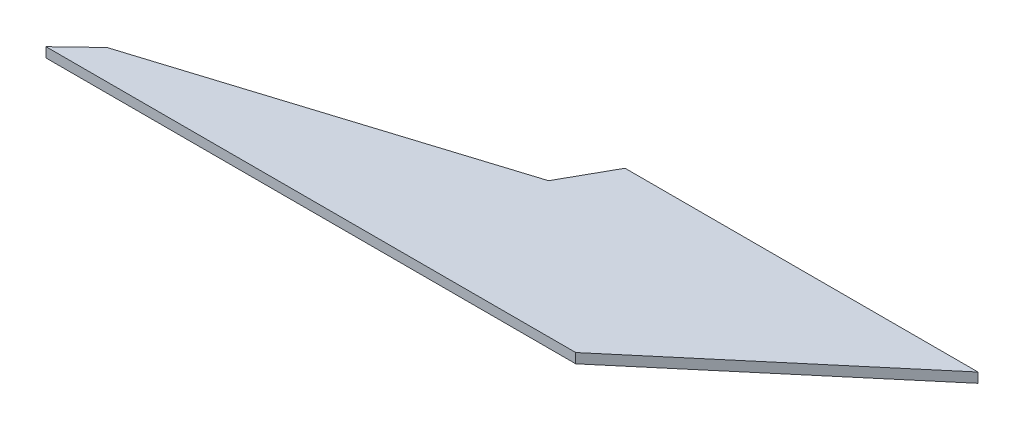
ISO-10303-21;
HEADER;
FILE_DESCRIPTION(('STEP AP214'),'2;1');
FILE_NAME('part.step','',(''),(''),'','','');
FILE_SCHEMA(('AUTOMOTIVE_DESIGN { 1 0 10303 214 1 1 1 1 }'));
ENDSEC;
DATA;
#1=APPLICATION_CONTEXT('core data for automotive mechanical design processes');
#2=APPLICATION_PROTOCOL_DEFINITION('international standard','automotive_design',2000,#1);
#3=PRODUCT_CONTEXT('',#1,'mechanical');
#4=PRODUCT('Part','Part','',(#3));
#5=PRODUCT_RELATED_PRODUCT_CATEGORY('part','',(#4));
#6=PRODUCT_DEFINITION_FORMATION('','',#4);
#7=PRODUCT_DEFINITION_CONTEXT('part definition',#1,'design');
#8=PRODUCT_DEFINITION('design','',#6,#7);
#9=PRODUCT_DEFINITION_SHAPE('','',#8);
#10=(LENGTH_UNIT() NAMED_UNIT(*) SI_UNIT(.MILLI.,.METRE.));
#11=(NAMED_UNIT(*) PLANE_ANGLE_UNIT() SI_UNIT($,.RADIAN.));
#12=(NAMED_UNIT(*) SI_UNIT($,.STERADIAN.) SOLID_ANGLE_UNIT());
#13=UNCERTAINTY_MEASURE_WITH_UNIT(LENGTH_MEASURE(1.E-05),#10,'distance_accuracy_value','');
#14=(GEOMETRIC_REPRESENTATION_CONTEXT(3) GLOBAL_UNCERTAINTY_ASSIGNED_CONTEXT((#13)) GLOBAL_UNIT_ASSIGNED_CONTEXT((#10,
#11,#12)) REPRESENTATION_CONTEXT('',''));
#15=CARTESIAN_POINT('',(0.,0.,0.));
#16=DIRECTION('',(0.,0.,1.));
#17=DIRECTION('',(1.,0.,0.));
#18=AXIS2_PLACEMENT_3D('',#15,#16,#17);
#19=CARTESIAN_POINT('',(80.5472641903663,2.,-37.5903219618737));
#20=DIRECTION('',(0.872762472166522,0.,0.488145129216487));
#21=DIRECTION('',(0.488145129216487,0.,-0.872762472166522));
#22=AXIS2_PLACEMENT_3D('',#19,#20,#21);
#23=PLANE('',#22);
#24=DIRECTION('',(-0.488145129216487,0.,0.872762472166522));
#25=VECTOR('',#24,1.);
#26=CARTESIAN_POINT('',(80.5472641903663,0.,-37.5903219618737));
#27=LINE('',#26,#25);
#28=CARTESIAN_POINT('',(80.5472641903663,0.,-37.5903219618737));
#29=VERTEX_POINT('',#28);
#30=CARTESIAN_POINT('',(74.9512614669705,0.,-27.5851393249791));
#31=VERTEX_POINT('',#30);
#32=EDGE_CURVE('E128',#29,#31,#27,.T.);
#33=ORIENTED_EDGE('',*,*,#32,.T.);
#34=DIRECTION('',(0.,-1.,0.));
#35=VECTOR('',#34,1.);
#36=CARTESIAN_POINT('',(74.9512614669705,2.,-27.5851393249791));
#37=LINE('',#36,#35);
#38=CARTESIAN_POINT('',(74.9512614669705,2.,-27.5851393249791));
#39=VERTEX_POINT('',#38);
#40=EDGE_CURVE('E11',#39,#31,#37,.T.);
#41=ORIENTED_EDGE('',*,*,#40,.F.);
#42=DIRECTION('',(-0.488145129216487,0.,0.872762472166522));
#43=VECTOR('',#42,1.);
#44=CARTESIAN_POINT('',(80.5472641903663,2.,-37.5903219618737));
#45=LINE('',#44,#43);
#46=CARTESIAN_POINT('',(80.5472641903663,2.,-37.5903219618737));
#47=VERTEX_POINT('',#46);
#48=EDGE_CURVE('E144',#47,#39,#45,.T.);
#49=ORIENTED_EDGE('',*,*,#48,.F.);
#50=DIRECTION('',(0.,-1.,0.));
#51=VECTOR('',#50,1.);
#52=CARTESIAN_POINT('',(80.5472641903663,2.,-37.5903219618737));
#53=LINE('',#52,#51);
#54=EDGE_CURVE('E124',#47,#29,#53,.T.);
#55=ORIENTED_EDGE('',*,*,#54,.T.);
#56=EDGE_LOOP('',(#33,#41,#49,#55));
#57=FACE_BOUND('',#56,.T.);
#58=ADVANCED_FACE('F39',(#57),#23,.F.);
#59=CARTESIAN_POINT('',(74.9512614669705,2.,-27.5851393249791));
#60=DIRECTION('',(0.299252637327374,0.,0.954173914468747));
#61=DIRECTION('',(0.954173914468747,0.,-0.299252637327374));
#62=AXIS2_PLACEMENT_3D('',#59,#60,#61);
#63=PLANE('',#62);
#64=DIRECTION('',(-0.954173914468747,0.,0.299252637327374));
#65=VECTOR('',#64,1.);
#66=CARTESIAN_POINT('',(74.9512614669705,0.,-27.5851393249791));
#67=LINE('',#66,#65);
#68=CARTESIAN_POINT('',(6.36680299605791,0.,-6.07534979303881));
#69=VERTEX_POINT('',#68);
#70=EDGE_CURVE('E132',#31,#69,#67,.T.);
#71=ORIENTED_EDGE('',*,*,#70,.T.);
#72=DIRECTION('',(0.,-1.,0.));
#73=VECTOR('',#72,1.);
#74=CARTESIAN_POINT('',(6.36680299605791,2.,-6.07534979303881));
#75=LINE('',#74,#73);
#76=CARTESIAN_POINT('',(6.36680299605791,2.,-6.07534979303881));
#77=VERTEX_POINT('',#76);
#78=EDGE_CURVE('E48',#77,#69,#75,.T.);
#79=ORIENTED_EDGE('',*,*,#78,.F.);
#80=DIRECTION('',(-0.954173914468747,0.,0.299252637327374));
#81=VECTOR('',#80,1.);
#82=CARTESIAN_POINT('',(74.9512614669705,2.,-27.5851393249791));
#83=LINE('',#82,#81);
#84=EDGE_CURVE('E93',#39,#77,#83,.T.);
#85=ORIENTED_EDGE('',*,*,#84,.F.);
#86=ORIENTED_EDGE('',*,*,#40,.T.);
#87=EDGE_LOOP('',(#71,#79,#85,#86));
#88=FACE_BOUND('',#87,.T.);
#89=ADVANCED_FACE('F172',(#88),#63,.F.);
#90=CARTESIAN_POINT('',(6.36680299605791,2.,-6.07534979303881));
#91=DIRECTION('',(0.69035366737915,0.,0.723472054702984));
#92=DIRECTION('',(0.723472054702984,0.,-0.69035366737915));
#93=AXIS2_PLACEMENT_3D('',#90,#91,#92);
#94=PLANE('',#93);
#95=DIRECTION('',(-0.723472054702984,0.,0.69035366737915));
#96=VECTOR('',#95,1.);
#97=CARTESIAN_POINT('',(6.36680299605791,0.,-6.07534979303881));
#98=LINE('',#97,#96);
#99=CARTESIAN_POINT('',(0.,0.,0.));
#100=VERTEX_POINT('',#99);
#101=EDGE_CURVE('E135',#69,#100,#98,.T.);
#102=ORIENTED_EDGE('',*,*,#101,.T.);
#103=DIRECTION('',(0.,-1.,0.));
#104=VECTOR('',#103,1.);
#105=CARTESIAN_POINT('',(0.,2.,0.));
#106=LINE('',#105,#104);
#107=CARTESIAN_POINT('',(0.,2.,0.));
#108=VERTEX_POINT('',#107);
#109=EDGE_CURVE('E117',#108,#100,#106,.T.);
#110=ORIENTED_EDGE('',*,*,#109,.F.);
#111=DIRECTION('',(-0.723472054702984,0.,0.69035366737915));
#112=VECTOR('',#111,1.);
#113=CARTESIAN_POINT('',(6.36680299605791,2.,-6.07534979303881));
#114=LINE('',#113,#112);
#115=EDGE_CURVE('E106',#77,#108,#114,.T.);
#116=ORIENTED_EDGE('',*,*,#115,.F.);
#117=ORIENTED_EDGE('',*,*,#78,.T.);
#118=EDGE_LOOP('',(#102,#110,#116,#117));
#119=FACE_BOUND('',#118,.T.);
#120=ADVANCED_FACE('F154',(#119),#94,.F.);
#121=CARTESIAN_POINT('',(0.,2.,0.));
#122=DIRECTION('',(0.,0.,-1.));
#123=DIRECTION('',(-1.,0.,0.));
#124=AXIS2_PLACEMENT_3D('',#121,#122,#123);
#125=PLANE('',#124);
#126=DIRECTION('',(1.,0.,0.));
#127=VECTOR('',#126,1.);
#128=CARTESIAN_POINT('',(0.,0.,0.));
#129=LINE('',#128,#127);
#130=CARTESIAN_POINT('',(108.078397399704,0.,0.));
#131=VERTEX_POINT('',#130);
#132=EDGE_CURVE('E115',#100,#131,#129,.T.);
#133=ORIENTED_EDGE('',*,*,#132,.T.);
#134=DIRECTION('',(0.,-1.,0.));
#135=VECTOR('',#134,1.);
#136=CARTESIAN_POINT('',(108.078397399704,2.,0.));
#137=LINE('',#136,#135);
#138=CARTESIAN_POINT('',(108.078397399704,2.,0.));
#139=VERTEX_POINT('',#138);
#140=EDGE_CURVE('E112',#139,#131,#137,.T.);
#141=ORIENTED_EDGE('',*,*,#140,.F.);
#142=DIRECTION('',(1.,0.,0.));
#143=VECTOR('',#142,1.);
#144=CARTESIAN_POINT('',(0.,2.,0.));
#145=LINE('',#144,#143);
#146=EDGE_CURVE('E100',#108,#139,#145,.T.);
#147=ORIENTED_EDGE('',*,*,#146,.F.);
#148=ORIENTED_EDGE('',*,*,#109,.T.);
#149=EDGE_LOOP('',(#133,#141,#147,#148));
#150=FACE_BOUND('',#149,.T.);
#151=ADVANCED_FACE('F113',(#150),#125,.F.);
#152=CARTESIAN_POINT('',(108.078397399704,2.,0.));
#153=DIRECTION('',(-0.645466040393807,0.,-0.763788970003063));
#154=DIRECTION('',(-0.763788970003063,0.,0.645466040393807));
#155=AXIS2_PLACEMENT_3D('',#152,#153,#154);
#156=PLANE('',#155);
#157=DIRECTION('',(0.763788970003063,0.,-0.645466040393807));
#158=VECTOR('',#157,1.);
#159=CARTESIAN_POINT('',(108.078397399704,0.,0.));
#160=LINE('',#159,#158);
#161=CARTESIAN_POINT('',(152.559549771138,0.,-37.5903219618736));
#162=VERTEX_POINT('',#161);
#163=EDGE_CURVE('E79',#131,#162,#160,.T.);
#164=ORIENTED_EDGE('',*,*,#163,.T.);
#165=DIRECTION('',(0.,-1.,0.));
#166=VECTOR('',#165,1.);
#167=CARTESIAN_POINT('',(152.559549771138,2.,-37.5903219618736));
#168=LINE('',#167,#166);
#169=CARTESIAN_POINT('',(152.559549771138,2.,-37.5903219618736));
#170=VERTEX_POINT('',#169);
#171=EDGE_CURVE('E118',#170,#162,#168,.T.);
#172=ORIENTED_EDGE('',*,*,#171,.F.);
#173=DIRECTION('',(0.763788970003063,0.,-0.645466040393807));
#174=VECTOR('',#173,1.);
#175=CARTESIAN_POINT('',(108.078397399704,2.,0.));
#176=LINE('',#175,#174);
#177=EDGE_CURVE('E104',#139,#170,#176,.T.);
#178=ORIENTED_EDGE('',*,*,#177,.F.);
#179=ORIENTED_EDGE('',*,*,#140,.T.);
#180=EDGE_LOOP('',(#164,#172,#178,#179));
#181=FACE_BOUND('',#180,.T.);
#182=ADVANCED_FACE('F120',(#181),#156,.F.);
#183=CARTESIAN_POINT('',(152.559549771138,2.,-37.5903219618736));
#184=DIRECTION('',(0.,0.,1.));
#185=DIRECTION('',(1.,0.,0.));
#186=AXIS2_PLACEMENT_3D('',#183,#184,#185);
#187=PLANE('',#186);
#188=DIRECTION('',(-1.,0.,0.));
#189=VECTOR('',#188,1.);
#190=CARTESIAN_POINT('',(152.559549771138,0.,-37.5903219618736));
#191=LINE('',#190,#189);
#192=EDGE_CURVE('E85',#162,#29,#191,.T.);
#193=ORIENTED_EDGE('',*,*,#192,.T.);
#194=ORIENTED_EDGE('',*,*,#54,.F.);
#195=DIRECTION('',(-1.,0.,0.));
#196=VECTOR('',#195,1.);
#197=CARTESIAN_POINT('',(152.559549771138,2.,-37.5903219618736));
#198=LINE('',#197,#196);
#199=EDGE_CURVE('E56',#170,#47,#198,.T.);
#200=ORIENTED_EDGE('',*,*,#199,.F.);
#201=ORIENTED_EDGE('',*,*,#171,.T.);
#202=EDGE_LOOP('',(#193,#194,#200,#201));
#203=FACE_BOUND('',#202,.T.);
#204=ADVANCED_FACE('F161',(#203),#187,.F.);
#205=CARTESIAN_POINT('',(0.,2.,0.));
#206=DIRECTION('',(0.,1.,0.));
#207=DIRECTION('',(0.,0.,1.));
#208=AXIS2_PLACEMENT_3D('',#205,#206,#207);
#209=PLANE('',#208);
#210=ORIENTED_EDGE('',*,*,#48,.T.);
#211=ORIENTED_EDGE('',*,*,#84,.T.);
#212=ORIENTED_EDGE('',*,*,#115,.T.);
#213=ORIENTED_EDGE('',*,*,#146,.T.);
#214=ORIENTED_EDGE('',*,*,#177,.T.);
#215=ORIENTED_EDGE('',*,*,#199,.T.);
#216=EDGE_LOOP('',(#210,#211,#212,#213,#214,#215));
#217=FACE_BOUND('',#216,.T.);
#218=ADVANCED_FACE('F102',(#217),#209,.T.);
#219=CARTESIAN_POINT('',(0.,0.,0.));
#220=DIRECTION('',(0.,1.,0.));
#221=DIRECTION('',(0.,0.,1.));
#222=AXIS2_PLACEMENT_3D('',#219,#220,#221);
#223=PLANE('',#222);
#224=ORIENTED_EDGE('',*,*,#32,.F.);
#225=ORIENTED_EDGE('',*,*,#192,.F.);
#226=ORIENTED_EDGE('',*,*,#163,.F.);
#227=ORIENTED_EDGE('',*,*,#132,.F.);
#228=ORIENTED_EDGE('',*,*,#101,.F.);
#229=ORIENTED_EDGE('',*,*,#70,.F.);
#230=EDGE_LOOP('',(#224,#225,#226,#227,#228,#229));
#231=FACE_BOUND('',#230,.T.);
#232=ADVANCED_FACE('F157',(#231),#223,.F.);
#233=CLOSED_SHELL('',(#58,#89,#120,#151,#182,#204,#218,#232));
#234=MANIFOLD_SOLID_BREP('B2',#233);
#235=ADVANCED_BREP_SHAPE_REPRESENTATION('',(#18,#234),#14);
#236=SHAPE_DEFINITION_REPRESENTATION(#9,#235);
ENDSEC;
END-ISO-10303-21;
